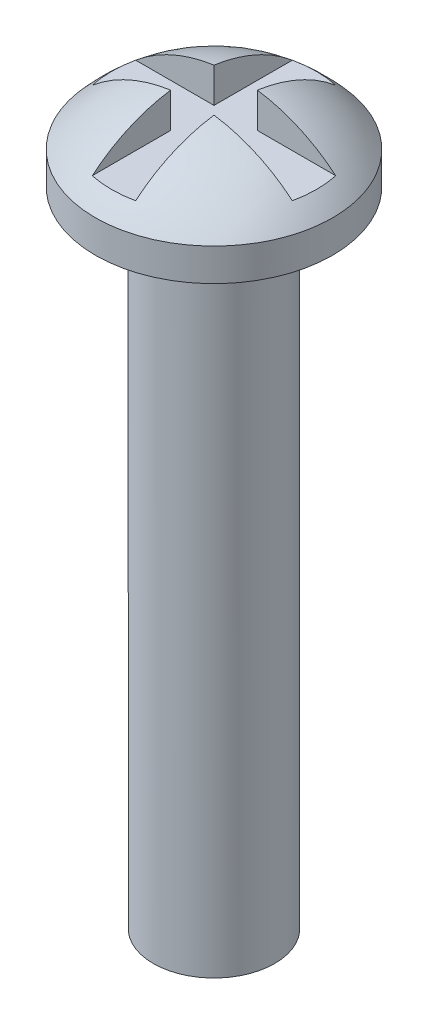
ISO-10303-21;
HEADER;
FILE_DESCRIPTION(('STEP AP214'),'2;1');
FILE_NAME('part.step','',(''),(''),'','','');
FILE_SCHEMA(('AUTOMOTIVE_DESIGN { 1 0 10303 214 1 1 1 1 }'));
ENDSEC;
DATA;
#1=APPLICATION_CONTEXT('core data for automotive mechanical design processes');
#2=APPLICATION_PROTOCOL_DEFINITION('international standard','automotive_design',2000,#1);
#3=PRODUCT_CONTEXT('',#1,'mechanical');
#4=PRODUCT('Part','Part','',(#3));
#5=PRODUCT_RELATED_PRODUCT_CATEGORY('part','',(#4));
#6=PRODUCT_DEFINITION_FORMATION('','',#4);
#7=PRODUCT_DEFINITION_CONTEXT('part definition',#1,'design');
#8=PRODUCT_DEFINITION('design','',#6,#7);
#9=PRODUCT_DEFINITION_SHAPE('','',#8);
#10=(LENGTH_UNIT() NAMED_UNIT(*) SI_UNIT(.MILLI.,.METRE.));
#11=(NAMED_UNIT(*) PLANE_ANGLE_UNIT() SI_UNIT($,.RADIAN.));
#12=(NAMED_UNIT(*) SI_UNIT($,.STERADIAN.) SOLID_ANGLE_UNIT());
#13=UNCERTAINTY_MEASURE_WITH_UNIT(LENGTH_MEASURE(1.E-05),#10,'distance_accuracy_value','');
#14=(GEOMETRIC_REPRESENTATION_CONTEXT(3) GLOBAL_UNCERTAINTY_ASSIGNED_CONTEXT((#13)) GLOBAL_UNIT_ASSIGNED_CONTEXT((#10,
#11,#12)) REPRESENTATION_CONTEXT('',''));
#15=CARTESIAN_POINT('',(0.,0.,0.));
#16=DIRECTION('',(0.,0.,1.));
#17=DIRECTION('',(1.,0.,0.));
#18=AXIS2_PLACEMENT_3D('',#15,#16,#17);
#19=CARTESIAN_POINT('',(-0.508,1.143,3.33756));
#20=DIRECTION('',(0.,-1.,0.));
#21=DIRECTION('',(0.,0.,-1.));
#22=AXIS2_PLACEMENT_3D('',#19,#20,#21);
#23=PLANE('',#22);
#24=DIRECTION('',(1.,0.,0.));
#25=VECTOR('',#24,1.);
#26=CARTESIAN_POINT('',(3.33756,1.143,0.508));
#27=LINE('',#26,#25);
#28=CARTESIAN_POINT('',(0.508,1.143,0.508));
#29=VERTEX_POINT('',#28);
#30=CARTESIAN_POINT('',(2.34426657677833,1.143,0.508));
#31=VERTEX_POINT('',#30);
#32=EDGE_CURVE('E150',#29,#31,#27,.T.);
#33=ORIENTED_EDGE('',*,*,#32,.T.);
#34=CARTESIAN_POINT('',(0.,1.143,0.));
#35=DIRECTION('',(0.,-1.,0.));
#36=DIRECTION('',(0.,0.,-1.));
#37=AXIS2_PLACEMENT_3D('',#34,#35,#36);
#38=CIRCLE('',#37,2.398676673293);
#39=CARTESIAN_POINT('',(2.34426657677833,1.143,-0.508));
#40=VERTEX_POINT('',#39);
#41=EDGE_CURVE('E115',#40,#31,#38,.T.);
#42=ORIENTED_EDGE('',*,*,#41,.F.);
#43=DIRECTION('',(-1.,0.,0.));
#44=VECTOR('',#43,1.);
#45=CARTESIAN_POINT('',(3.33756,1.143,-0.508));
#46=LINE('',#45,#44);
#47=CARTESIAN_POINT('',(0.508,1.143,-0.508));
#48=VERTEX_POINT('',#47);
#49=EDGE_CURVE('E117',#40,#48,#46,.T.);
#50=ORIENTED_EDGE('',*,*,#49,.T.);
#51=DIRECTION('',(0.,0.,-1.));
#52=VECTOR('',#51,1.);
#53=CARTESIAN_POINT('',(0.508,1.143,3.33756));
#54=LINE('',#53,#52);
#55=CARTESIAN_POINT('',(0.508,1.143,-2.34426657677833));
#56=VERTEX_POINT('',#55);
#57=EDGE_CURVE('E114',#48,#56,#54,.T.);
#58=ORIENTED_EDGE('',*,*,#57,.T.);
#59=CARTESIAN_POINT('',(0.,1.143,0.));
#60=DIRECTION('',(0.,-1.,0.));
#61=DIRECTION('',(0.,0.,-1.));
#62=AXIS2_PLACEMENT_3D('',#59,#60,#61);
#63=CIRCLE('',#62,2.398676673293);
#64=CARTESIAN_POINT('',(-0.507999999999997,1.143,-2.34426657677833));
#65=VERTEX_POINT('',#64);
#66=EDGE_CURVE('E118',#65,#56,#63,.T.);
#67=ORIENTED_EDGE('',*,*,#66,.F.);
#68=DIRECTION('',(0.,0.,1.));
#69=VECTOR('',#68,1.);
#70=CARTESIAN_POINT('',(-0.508,1.143,3.33756));
#71=LINE('',#70,#69);
#72=CARTESIAN_POINT('',(-0.508,1.143,-0.508));
#73=VERTEX_POINT('',#72);
#74=EDGE_CURVE('E126',#65,#73,#71,.T.);
#75=ORIENTED_EDGE('',*,*,#74,.T.);
#76=DIRECTION('',(-1.,0.,0.));
#77=VECTOR('',#76,1.);
#78=CARTESIAN_POINT('',(3.33756,1.143,-0.508));
#79=LINE('',#78,#77);
#80=CARTESIAN_POINT('',(-2.34426657677833,1.143,-0.508));
#81=VERTEX_POINT('',#80);
#82=EDGE_CURVE('E124',#73,#81,#79,.T.);
#83=ORIENTED_EDGE('',*,*,#82,.T.);
#84=CARTESIAN_POINT('',(0.,1.143,0.));
#85=DIRECTION('',(0.,-1.,0.));
#86=DIRECTION('',(0.,0.,-1.));
#87=AXIS2_PLACEMENT_3D('',#84,#85,#86);
#88=CIRCLE('',#87,2.398676673293);
#89=CARTESIAN_POINT('',(-2.34426657677833,1.143,0.508));
#90=VERTEX_POINT('',#89);
#91=EDGE_CURVE('E89',#90,#81,#88,.T.);
#92=ORIENTED_EDGE('',*,*,#91,.F.);
#93=DIRECTION('',(1.,0.,0.));
#94=VECTOR('',#93,1.);
#95=CARTESIAN_POINT('',(3.33756,1.143,0.508));
#96=LINE('',#95,#94);
#97=CARTESIAN_POINT('',(-0.508,1.143,0.508));
#98=VERTEX_POINT('',#97);
#99=EDGE_CURVE('E94',#90,#98,#96,.T.);
#100=ORIENTED_EDGE('',*,*,#99,.T.);
#101=DIRECTION('',(0.,0.,1.));
#102=VECTOR('',#101,1.);
#103=CARTESIAN_POINT('',(-0.508,1.143,3.33756));
#104=LINE('',#103,#102);
#105=CARTESIAN_POINT('',(-0.508,1.143,2.34426657677833));
#106=VERTEX_POINT('',#105);
#107=EDGE_CURVE('E91',#98,#106,#104,.T.);
#108=ORIENTED_EDGE('',*,*,#107,.T.);
#109=CARTESIAN_POINT('',(0.,1.143,0.));
#110=DIRECTION('',(0.,-1.,0.));
#111=DIRECTION('',(0.,0.,-1.));
#112=AXIS2_PLACEMENT_3D('',#109,#110,#111);
#113=CIRCLE('',#112,2.398676673293);
#114=CARTESIAN_POINT('',(0.507999999999997,1.143,2.34426657677833));
#115=VERTEX_POINT('',#114);
#116=EDGE_CURVE('E20',#115,#106,#113,.T.);
#117=ORIENTED_EDGE('',*,*,#116,.F.);
#118=DIRECTION('',(0.,0.,-1.));
#119=VECTOR('',#118,1.);
#120=CARTESIAN_POINT('',(0.508,1.143,3.33756));
#121=LINE('',#120,#119);
#122=EDGE_CURVE('E154',#115,#29,#121,.T.);
#123=ORIENTED_EDGE('',*,*,#122,.T.);
#124=EDGE_LOOP('',(#33,#42,#50,#58,#67,#75,#83,#92,#100,#108,#117,#123));
#125=FACE_BOUND('',#124,.T.);
#126=ADVANCED_FACE('F16',(#125),#23,.F.);
#127=CARTESIAN_POINT('',(3.33756,1.143,-0.508));
#128=DIRECTION('',(0.,0.,-1.));
#129=DIRECTION('',(-1.,0.,0.));
#130=AXIS2_PLACEMENT_3D('',#127,#128,#129);
#131=PLANE('',#130);
#132=CARTESIAN_POINT('',(0.,-1.6485235,-0.508));
#133=DIRECTION('',(0.,0.,-1.));
#134=DIRECTION('',(-1.,0.,0.));
#135=AXIS2_PLACEMENT_3D('',#132,#133,#134);
#136=CIRCLE('',#135,3.64529686501007);
#137=CARTESIAN_POINT('',(0.508,1.96120297634862,-0.508));
#138=VERTEX_POINT('',#137);
#139=EDGE_CURVE('E111',#138,#40,#136,.T.);
#140=ORIENTED_EDGE('',*,*,#139,.F.);
#141=DIRECTION('',(0.,1.,0.));
#142=VECTOR('',#141,1.);
#143=CARTESIAN_POINT('',(0.508,1.143,-0.508));
#144=LINE('',#143,#142);
#145=EDGE_CURVE('E177',#138,#48,#144,.F.);
#146=ORIENTED_EDGE('',*,*,#145,.T.);
#147=ORIENTED_EDGE('',*,*,#49,.F.);
#148=EDGE_LOOP('',(#140,#146,#147));
#149=FACE_BOUND('',#148,.T.);
#150=ADVANCED_FACE('F287',(#149),#131,.F.);
#151=CARTESIAN_POINT('',(3.33756,3.18147932635552,0.508));
#152=DIRECTION('',(0.,0.,1.));
#153=DIRECTION('',(1.,0.,0.));
#154=AXIS2_PLACEMENT_3D('',#151,#152,#153);
#155=PLANE('',#154);
#156=CARTESIAN_POINT('',(0.,-1.6485235,0.508));
#157=DIRECTION('',(0.,0.,1.));
#158=DIRECTION('',(1.,0.,0.));
#159=AXIS2_PLACEMENT_3D('',#156,#157,#158);
#160=CIRCLE('',#159,3.64529686501007);
#161=CARTESIAN_POINT('',(0.507999999999997,1.96120297634862,0.508));
#162=VERTEX_POINT('',#161);
#163=EDGE_CURVE('E106',#31,#162,#160,.T.);
#164=ORIENTED_EDGE('',*,*,#163,.F.);
#165=ORIENTED_EDGE('',*,*,#32,.F.);
#166=DIRECTION('',(0.,1.,0.));
#167=VECTOR('',#166,1.);
#168=CARTESIAN_POINT('',(0.508,1.143,0.508));
#169=LINE('',#168,#167);
#170=EDGE_CURVE('E98',#29,#162,#169,.T.);
#171=ORIENTED_EDGE('',*,*,#170,.T.);
#172=EDGE_LOOP('',(#164,#165,#171));
#173=FACE_BOUND('',#172,.T.);
#174=ADVANCED_FACE('F277',(#173),#155,.F.);
#175=CARTESIAN_POINT('',(0.508,1.143,3.33756));
#176=DIRECTION('',(1.,0.,0.));
#177=DIRECTION('',(0.,0.,-1.));
#178=AXIS2_PLACEMENT_3D('',#175,#176,#177);
#179=PLANE('',#178);
#180=ORIENTED_EDGE('',*,*,#170,.F.);
#181=ORIENTED_EDGE('',*,*,#122,.F.);
#182=CARTESIAN_POINT('',(0.507999999999994,-1.6485235,0.));
#183=DIRECTION('',(-1.,0.,0.));
#184=DIRECTION('',(0.,0.,1.));
#185=AXIS2_PLACEMENT_3D('',#182,#183,#184);
#186=CIRCLE('',#185,3.64529686501007);
#187=EDGE_CURVE('E88',#162,#115,#186,.F.);
#188=ORIENTED_EDGE('',*,*,#187,.F.);
#189=EDGE_LOOP('',(#180,#181,#188));
#190=FACE_BOUND('',#189,.T.);
#191=ADVANCED_FACE('F268',(#190),#179,.F.);
#192=CARTESIAN_POINT('',(-0.508,4.318,3.33756));
#193=DIRECTION('',(-1.,0.,0.));
#194=DIRECTION('',(0.,0.,1.));
#195=AXIS2_PLACEMENT_3D('',#192,#193,#194);
#196=PLANE('',#195);
#197=DIRECTION('',(0.,1.,0.));
#198=VECTOR('',#197,1.);
#199=CARTESIAN_POINT('',(-0.508,3.18147932635552,0.508));
#200=LINE('',#199,#198);
#201=CARTESIAN_POINT('',(-0.508,1.96120297634862,0.508));
#202=VERTEX_POINT('',#201);
#203=EDGE_CURVE('E97',#98,#202,#200,.T.);
#204=ORIENTED_EDGE('',*,*,#203,.T.);
#205=CARTESIAN_POINT('',(-0.508,-1.6485235,0.));
#206=DIRECTION('',(-1.,0.,0.));
#207=DIRECTION('',(0.,0.,1.));
#208=AXIS2_PLACEMENT_3D('',#205,#206,#207);
#209=CIRCLE('',#208,3.64529686501007);
#210=EDGE_CURVE('E85',#106,#202,#209,.T.);
#211=ORIENTED_EDGE('',*,*,#210,.F.);
#212=ORIENTED_EDGE('',*,*,#107,.F.);
#213=EDGE_LOOP('',(#204,#211,#212));
#214=FACE_BOUND('',#213,.T.);
#215=ADVANCED_FACE('F100',(#214),#196,.F.);
#216=CARTESIAN_POINT('',(3.33756,3.18147932635552,0.508));
#217=DIRECTION('',(0.,0.,1.));
#218=DIRECTION('',(1.,0.,0.));
#219=AXIS2_PLACEMENT_3D('',#216,#217,#218);
#220=PLANE('',#219);
#221=CARTESIAN_POINT('',(0.,-1.6485235,0.508));
#222=DIRECTION('',(0.,0.,1.));
#223=DIRECTION('',(1.,0.,0.));
#224=AXIS2_PLACEMENT_3D('',#221,#222,#223);
#225=CIRCLE('',#224,3.64529686501007);
#226=EDGE_CURVE('E102',#202,#90,#225,.T.);
#227=ORIENTED_EDGE('',*,*,#226,.F.);
#228=ORIENTED_EDGE('',*,*,#203,.F.);
#229=ORIENTED_EDGE('',*,*,#99,.F.);
#230=EDGE_LOOP('',(#227,#228,#229));
#231=FACE_BOUND('',#230,.T.);
#232=ADVANCED_FACE('F201',(#231),#220,.F.);
#233=CARTESIAN_POINT('',(3.33756,1.143,-0.508));
#234=DIRECTION('',(0.,0.,-1.));
#235=DIRECTION('',(-1.,0.,0.));
#236=AXIS2_PLACEMENT_3D('',#233,#234,#235);
#237=PLANE('',#236);
#238=CARTESIAN_POINT('',(0.,-1.6485235,-0.508));
#239=DIRECTION('',(0.,0.,-1.));
#240=DIRECTION('',(-1.,0.,0.));
#241=AXIS2_PLACEMENT_3D('',#238,#239,#240);
#242=CIRCLE('',#241,3.64529686501007);
#243=CARTESIAN_POINT('',(-0.507999999999997,1.96120297634862,-0.508));
#244=VERTEX_POINT('',#243);
#245=EDGE_CURVE('E104',#81,#244,#242,.T.);
#246=ORIENTED_EDGE('',*,*,#245,.F.);
#247=ORIENTED_EDGE('',*,*,#82,.F.);
#248=DIRECTION('',(0.,1.,0.));
#249=VECTOR('',#248,1.);
#250=CARTESIAN_POINT('',(-0.508,4.318,-0.508));
#251=LINE('',#250,#249);
#252=EDGE_CURVE('E131',#73,#244,#251,.T.);
#253=ORIENTED_EDGE('',*,*,#252,.T.);
#254=EDGE_LOOP('',(#246,#247,#253));
#255=FACE_BOUND('',#254,.T.);
#256=ADVANCED_FACE('F130',(#255),#237,.F.);
#257=CARTESIAN_POINT('',(-0.508,4.318,3.33756));
#258=DIRECTION('',(-1.,0.,0.));
#259=DIRECTION('',(0.,0.,1.));
#260=AXIS2_PLACEMENT_3D('',#257,#258,#259);
#261=PLANE('',#260);
#262=ORIENTED_EDGE('',*,*,#252,.F.);
#263=ORIENTED_EDGE('',*,*,#74,.F.);
#264=CARTESIAN_POINT('',(-0.507999999999994,-1.6485235,0.));
#265=DIRECTION('',(-1.,0.,0.));
#266=DIRECTION('',(0.,0.,1.));
#267=AXIS2_PLACEMENT_3D('',#264,#265,#266);
#268=CIRCLE('',#267,3.64529686501007);
#269=EDGE_CURVE('E133',#244,#65,#268,.T.);
#270=ORIENTED_EDGE('',*,*,#269,.F.);
#271=EDGE_LOOP('',(#262,#263,#270));
#272=FACE_BOUND('',#271,.T.);
#273=ADVANCED_FACE('F192',(#272),#261,.F.);
#274=CARTESIAN_POINT('',(0.508,1.143,3.33756));
#275=DIRECTION('',(1.,0.,0.));
#276=DIRECTION('',(0.,0.,-1.));
#277=AXIS2_PLACEMENT_3D('',#274,#275,#276);
#278=PLANE('',#277);
#279=ORIENTED_EDGE('',*,*,#145,.F.);
#280=CARTESIAN_POINT('',(0.508,-1.6485235,0.));
#281=DIRECTION('',(-1.,0.,0.));
#282=DIRECTION('',(0.,0.,1.));
#283=AXIS2_PLACEMENT_3D('',#280,#281,#282);
#284=CIRCLE('',#283,3.64529686501007);
#285=EDGE_CURVE('E134',#56,#138,#284,.F.);
#286=ORIENTED_EDGE('',*,*,#285,.F.);
#287=ORIENTED_EDGE('',*,*,#57,.F.);
#288=EDGE_LOOP('',(#279,#286,#287));
#289=FACE_BOUND('',#288,.T.);
#290=ADVANCED_FACE('F190',(#289),#278,.F.);
#291=CARTESIAN_POINT('',(0.,-1.6485235,0.));
#292=DIRECTION('',(-1.,0.,0.));
#293=DIRECTION('',(0.,0.64713728840334,0.762373484558567));
#294=AXIS2_PLACEMENT_3D('',#291,#292,#293);
#295=SPHERICAL_SURFACE('',#294,3.6805235);
#296=ORIENTED_EDGE('',*,*,#66,.T.);
#297=ORIENTED_EDGE('',*,*,#285,.T.);
#298=ORIENTED_EDGE('',*,*,#139,.T.);
#299=ORIENTED_EDGE('',*,*,#41,.T.);
#300=ORIENTED_EDGE('',*,*,#163,.T.);
#301=ORIENTED_EDGE('',*,*,#187,.T.);
#302=ORIENTED_EDGE('',*,*,#116,.T.);
#303=ORIENTED_EDGE('',*,*,#210,.T.);
#304=ORIENTED_EDGE('',*,*,#226,.T.);
#305=ORIENTED_EDGE('',*,*,#91,.T.);
#306=ORIENTED_EDGE('',*,*,#245,.T.);
#307=ORIENTED_EDGE('',*,*,#269,.T.);
#308=EDGE_LOOP('',(#296,#297,#298,#299,#300,#301,#302,#303,#304,#305,#306,#307));
#309=FACE_BOUND('',#308,.T.);
#310=CARTESIAN_POINT('',(0.,0.762,0.));
#311=DIRECTION('',(0.,-1.,0.));
#312=DIRECTION('',(0.,0.,-1.));
#313=AXIS2_PLACEMENT_3D('',#310,#311,#312);
#314=CIRCLE('',#313,2.7813);
#315=CARTESIAN_POINT('',(0.,0.762,-2.7813));
#316=VERTEX_POINT('',#315);
#317=EDGE_CURVE('E139',#316,#316,#314,.T.);
#318=ORIENTED_EDGE('',*,*,#317,.F.);
#319=EDGE_LOOP('',(#318));
#320=FACE_BOUND('',#319,.T.);
#321=ADVANCED_FACE('F18',(#309,#320),#295,.T.);
#322=CARTESIAN_POINT('',(0.,2.92735,0.));
#323=DIRECTION('',(0.,-1.,0.));
#324=DIRECTION('',(0.,0.,-1.));
#325=AXIS2_PLACEMENT_3D('',#322,#323,#324);
#326=CYLINDRICAL_SURFACE('',#325,2.7813);
#327=ORIENTED_EDGE('',*,*,#317,.T.);
#328=EDGE_LOOP('',(#327));
#329=FACE_BOUND('',#328,.T.);
#330=CARTESIAN_POINT('',(0.,0.,0.));
#331=DIRECTION('',(0.,-1.,0.));
#332=DIRECTION('',(0.,0.,-1.));
#333=AXIS2_PLACEMENT_3D('',#330,#331,#332);
#334=CIRCLE('',#333,2.7813);
#335=CARTESIAN_POINT('',(0.,0.,-2.7813));
#336=VERTEX_POINT('',#335);
#337=EDGE_CURVE('E142',#336,#336,#334,.T.);
#338=ORIENTED_EDGE('',*,*,#337,.F.);
#339=EDGE_LOOP('',(#338));
#340=FACE_BOUND('',#339,.T.);
#341=ADVANCED_FACE('F217',(#329,#340),#326,.T.);
#342=CARTESIAN_POINT('',(0.,0.,0.));
#343=DIRECTION('',(0.,-1.,0.));
#344=DIRECTION('',(0.,0.,-1.));
#345=AXIS2_PLACEMENT_3D('',#342,#343,#344);
#346=PLANE('',#345);
#347=ORIENTED_EDGE('',*,*,#337,.T.);
#348=EDGE_LOOP('',(#347));
#349=FACE_BOUND('',#348,.T.);
#350=CARTESIAN_POINT('',(0.,0.,0.));
#351=DIRECTION('',(0.,-1.,0.));
#352=DIRECTION('',(0.,0.,-1.));
#353=AXIS2_PLACEMENT_3D('',#350,#351,#352);
#354=CIRCLE('',#353,1.4224);
#355=CARTESIAN_POINT('',(0.,0.,-1.4224));
#356=VERTEX_POINT('',#355);
#357=EDGE_CURVE('E26',#356,#356,#354,.T.);
#358=ORIENTED_EDGE('',*,*,#357,.F.);
#359=EDGE_LOOP('',(#358));
#360=FACE_BOUND('',#359,.T.);
#361=ADVANCED_FACE('F211',(#349,#360),#346,.T.);
#362=CARTESIAN_POINT('',(0.,-15.0537769771972,0.));
#363=DIRECTION('',(0.,1.,0.));
#364=DIRECTION('',(0.,0.,1.));
#365=AXIS2_PLACEMENT_3D('',#362,#363,#364);
#366=CONICAL_SURFACE('',#365,1.4223999998535,1.04719755088565);
#367=CARTESIAN_POINT('',(0.,-15.8750000001362,-1.42108547151945E-10));
#368=VERTEX_POINT('',#367);
#369=VERTEX_LOOP('',#368);
#370=FACE_BOUND('',#369,.T.);
#371=CARTESIAN_POINT('',(0.,-15.0537769771052,0.));
#372=DIRECTION('',(0.,-1.,0.));
#373=DIRECTION('',(0.,0.,-1.));
#374=AXIS2_PLACEMENT_3D('',#371,#372,#373);
#375=CIRCLE('',#374,1.4224);
#376=CARTESIAN_POINT('',(0.,-15.0537769771052,-1.4224));
#377=VERTEX_POINT('',#376);
#378=EDGE_CURVE('E11',#377,#377,#375,.F.);
#379=ORIENTED_EDGE('',*,*,#378,.F.);
#380=EDGE_LOOP('',(#379));
#381=FACE_BOUND('',#380,.T.);
#382=ADVANCED_FACE('F205',(#370,#381),#366,.T.);
#383=CARTESIAN_POINT('',(0.,2.92735,0.));
#384=DIRECTION('',(0.,-1.,0.));
#385=DIRECTION('',(0.,0.,-1.));
#386=AXIS2_PLACEMENT_3D('',#383,#384,#385);
#387=CYLINDRICAL_SURFACE('',#386,1.4224);
#388=ORIENTED_EDGE('',*,*,#378,.T.);
#389=EDGE_LOOP('',(#388));
#390=FACE_BOUND('',#389,.T.);
#391=ORIENTED_EDGE('',*,*,#357,.T.);
#392=EDGE_LOOP('',(#391));
#393=FACE_BOUND('',#392,.T.);
#394=ADVANCED_FACE('F203',(#390,#393),#387,.T.);
#395=CLOSED_SHELL('',(#126,#150,#174,#191,#215,#232,#256,#273,#290,#321,#341,#361,#382,#394));
#396=MANIFOLD_SOLID_BREP('B1',#395);
#397=ADVANCED_BREP_SHAPE_REPRESENTATION('',(#18,#396),#14);
#398=SHAPE_DEFINITION_REPRESENTATION(#9,#397);
ENDSEC;
END-ISO-10303-21;
